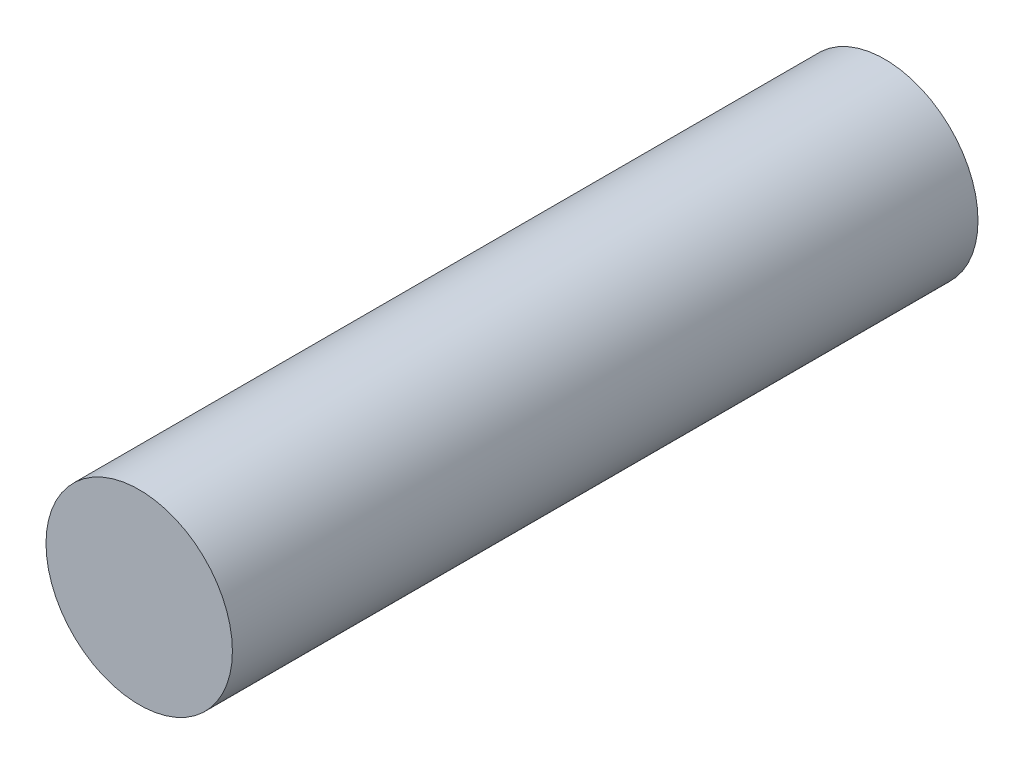
ISO-10303-21;
HEADER;
FILE_DESCRIPTION(('STEP AP214'),'2;1');
FILE_NAME('part.step','',(''),(''),'','','');
FILE_SCHEMA(('AUTOMOTIVE_DESIGN { 1 0 10303 214 1 1 1 1 }'));
ENDSEC;
DATA;
#1=APPLICATION_CONTEXT('core data for automotive mechanical design processes');
#2=APPLICATION_PROTOCOL_DEFINITION('international standard','automotive_design',2000,#1);
#3=PRODUCT_CONTEXT('',#1,'mechanical');
#4=PRODUCT('Part','Part','',(#3));
#5=PRODUCT_RELATED_PRODUCT_CATEGORY('part','',(#4));
#6=PRODUCT_DEFINITION_FORMATION('','',#4);
#7=PRODUCT_DEFINITION_CONTEXT('part definition',#1,'design');
#8=PRODUCT_DEFINITION('design','',#6,#7);
#9=PRODUCT_DEFINITION_SHAPE('','',#8);
#10=(LENGTH_UNIT() NAMED_UNIT(*) SI_UNIT(.MILLI.,.METRE.));
#11=(NAMED_UNIT(*) PLANE_ANGLE_UNIT() SI_UNIT($,.RADIAN.));
#12=(NAMED_UNIT(*) SI_UNIT($,.STERADIAN.) SOLID_ANGLE_UNIT());
#13=UNCERTAINTY_MEASURE_WITH_UNIT(LENGTH_MEASURE(1.E-05),#10,'distance_accuracy_value','');
#14=(GEOMETRIC_REPRESENTATION_CONTEXT(3) GLOBAL_UNCERTAINTY_ASSIGNED_CONTEXT((#13)) GLOBAL_UNIT_ASSIGNED_CONTEXT((#10,
#11,#12)) REPRESENTATION_CONTEXT('',''));
#15=CARTESIAN_POINT('',(0.,0.,0.));
#16=DIRECTION('',(0.,0.,1.));
#17=DIRECTION('',(1.,0.,0.));
#18=AXIS2_PLACEMENT_3D('',#15,#16,#17);
#19=CARTESIAN_POINT('',(0.,0.,50.8));
#20=DIRECTION('',(0.,0.,-1.));
#21=DIRECTION('',(-1.,0.,0.));
#22=AXIS2_PLACEMENT_3D('',#19,#20,#21);
#23=CYLINDRICAL_SURFACE('',#22,6.35);
#24=CARTESIAN_POINT('',(0.,0.,50.8));
#25=DIRECTION('',(0.,0.,1.));
#26=DIRECTION('',(1.,0.,0.));
#27=AXIS2_PLACEMENT_3D('',#24,#25,#26);
#28=CIRCLE('',#27,6.35);
#29=CARTESIAN_POINT('',(6.35,0.,50.8));
#30=VERTEX_POINT('',#29);
#31=EDGE_CURVE('E10',#30,#30,#28,.T.);
#32=ORIENTED_EDGE('',*,*,#31,.F.);
#33=EDGE_LOOP('',(#32));
#34=FACE_BOUND('',#33,.T.);
#35=CARTESIAN_POINT('',(0.,0.,0.));
#36=DIRECTION('',(0.,0.,1.));
#37=DIRECTION('',(1.,0.,0.));
#38=AXIS2_PLACEMENT_3D('',#35,#36,#37);
#39=CIRCLE('',#38,6.35);
#40=CARTESIAN_POINT('',(6.35,0.,0.));
#41=VERTEX_POINT('',#40);
#42=EDGE_CURVE('E35',#41,#41,#39,.T.);
#43=ORIENTED_EDGE('',*,*,#42,.T.);
#44=EDGE_LOOP('',(#43));
#45=FACE_BOUND('',#44,.T.);
#46=ADVANCED_FACE('F32',(#34,#45),#23,.T.);
#47=CARTESIAN_POINT('',(0.,0.,50.8));
#48=DIRECTION('',(0.,0.,1.));
#49=DIRECTION('',(1.,0.,0.));
#50=AXIS2_PLACEMENT_3D('',#47,#48,#49);
#51=PLANE('',#50);
#52=ORIENTED_EDGE('',*,*,#31,.T.);
#53=EDGE_LOOP('',(#52));
#54=FACE_BOUND('',#53,.T.);
#55=ADVANCED_FACE('F47',(#54),#51,.T.);
#56=CARTESIAN_POINT('',(0.,0.,0.));
#57=DIRECTION('',(0.,0.,1.));
#58=DIRECTION('',(1.,0.,0.));
#59=AXIS2_PLACEMENT_3D('',#56,#57,#58);
#60=PLANE('',#59);
#61=ORIENTED_EDGE('',*,*,#42,.F.);
#62=EDGE_LOOP('',(#61));
#63=FACE_BOUND('',#62,.T.);
#64=ADVANCED_FACE('F45',(#63),#60,.F.);
#65=CLOSED_SHELL('',(#46,#55,#64));
#66=MANIFOLD_SOLID_BREP('B2',#65);
#67=ADVANCED_BREP_SHAPE_REPRESENTATION('',(#18,#66),#14);
#68=SHAPE_DEFINITION_REPRESENTATION(#9,#67);
ENDSEC;
END-ISO-10303-21;
